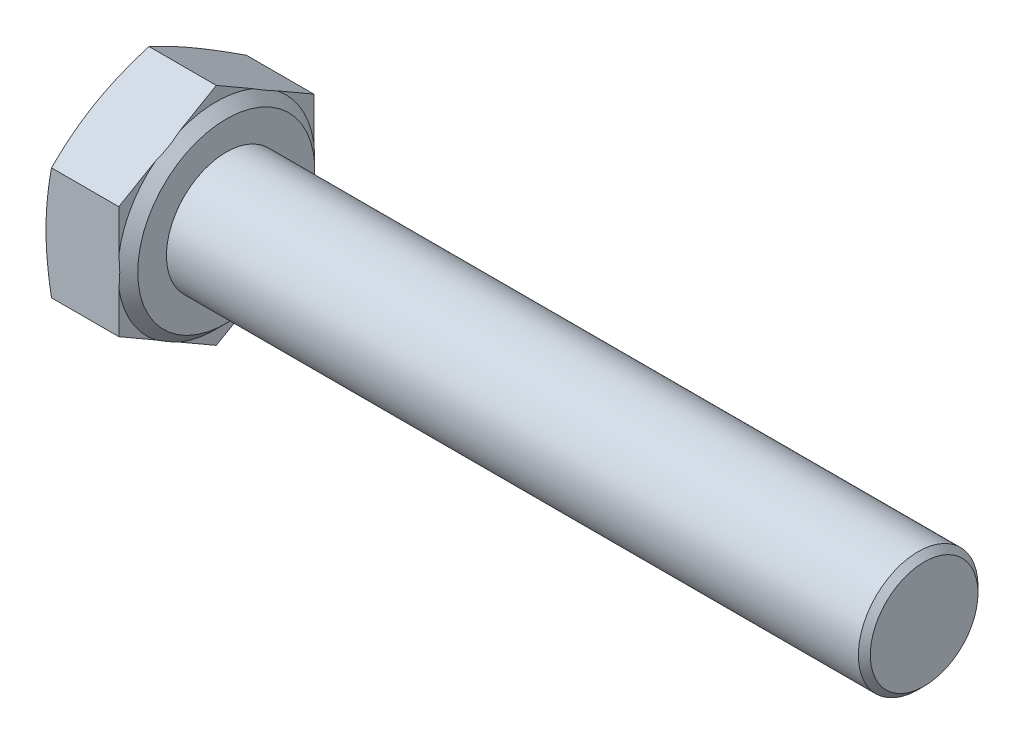
ISO-10303-21;
HEADER;
FILE_DESCRIPTION(('STEP AP214'),'2;1');
FILE_NAME('part.step','',(''),(''),'','','');
FILE_SCHEMA(('AUTOMOTIVE_DESIGN { 1 0 10303 214 1 1 1 1 }'));
ENDSEC;
DATA;
#1=APPLICATION_CONTEXT('core data for automotive mechanical design processes');
#2=APPLICATION_PROTOCOL_DEFINITION('international standard','automotive_design',2000,#1);
#3=PRODUCT_CONTEXT('',#1,'mechanical');
#4=PRODUCT('Part','Part','',(#3));
#5=PRODUCT_RELATED_PRODUCT_CATEGORY('part','',(#4));
#6=PRODUCT_DEFINITION_FORMATION('','',#4);
#7=PRODUCT_DEFINITION_CONTEXT('part definition',#1,'design');
#8=PRODUCT_DEFINITION('design','',#6,#7);
#9=PRODUCT_DEFINITION_SHAPE('','',#8);
#10=(LENGTH_UNIT() NAMED_UNIT(*) SI_UNIT(.MILLI.,.METRE.));
#11=(NAMED_UNIT(*) PLANE_ANGLE_UNIT() SI_UNIT($,.RADIAN.));
#12=(NAMED_UNIT(*) SI_UNIT($,.STERADIAN.) SOLID_ANGLE_UNIT());
#13=UNCERTAINTY_MEASURE_WITH_UNIT(LENGTH_MEASURE(1.E-05),#10,'distance_accuracy_value','');
#14=(GEOMETRIC_REPRESENTATION_CONTEXT(3) GLOBAL_UNCERTAINTY_ASSIGNED_CONTEXT((#13)) GLOBAL_UNIT_ASSIGNED_CONTEXT((#10,
#11,#12)) REPRESENTATION_CONTEXT('',''));
#15=CARTESIAN_POINT('',(0.,0.,0.));
#16=DIRECTION('',(0.,0.,1.));
#17=DIRECTION('',(1.,0.,0.));
#18=AXIS2_PLACEMENT_3D('',#15,#16,#17);
#19=CARTESIAN_POINT('',(4.15,-2.82324281633727,-4.89));
#20=DIRECTION('',(1.,0.,0.));
#21=DIRECTION('',(0.,0.,-1.));
#22=AXIS2_PLACEMENT_3D('',#19,#20,#21);
#23=PLANE('',#22);
#24=CARTESIAN_POINT('',(4.15,0.,0.));
#25=DIRECTION('',(-1.,0.,0.));
#26=DIRECTION('',(0.,0.,1.));
#27=AXIS2_PLACEMENT_3D('',#24,#25,#26);
#28=CIRCLE('',#27,4.44);
#29=CARTESIAN_POINT('',(4.15,0.,4.44));
#30=VERTEX_POINT('',#29);
#31=EDGE_CURVE('E349',#30,#30,#28,.T.);
#32=ORIENTED_EDGE('',*,*,#31,.F.);
#33=EDGE_LOOP('',(#32));
#34=FACE_BOUND('',#33,.T.);
#35=CARTESIAN_POINT('',(4.15,0.,0.));
#36=DIRECTION('',(1.,0.,0.));
#37=DIRECTION('',(0.,0.,-1.));
#38=AXIS2_PLACEMENT_3D('',#35,#36,#37);
#39=CIRCLE('',#38,3.);
#40=CARTESIAN_POINT('',(4.15,0.,-3.));
#41=VERTEX_POINT('',#40);
#42=EDGE_CURVE('E352',#41,#41,#39,.T.);
#43=ORIENTED_EDGE('',*,*,#42,.F.);
#44=EDGE_LOOP('',(#43));
#45=FACE_BOUND('',#44,.T.);
#46=ADVANCED_FACE('F37',(#34,#45),#23,.T.);
#47=CARTESIAN_POINT('',(4.15,-5.64648563267454,0.));
#48=DIRECTION('',(0.,0.866025403784439,0.5));
#49=DIRECTION('',(0.,-0.5,0.866025403784439));
#50=AXIS2_PLACEMENT_3D('',#47,#48,#49);
#51=PLANE('',#50);
#52=CARTESIAN_POINT('',(0.275380281895275,-2.82312734628343,-4.8902));
#53=CARTESIAN_POINT('',(0.232806027313738,-2.94005354571478,-4.68767788184897));
#54=CARTESIAN_POINT('',(0.194077322500994,-3.05736532610898,-4.48448791787986));
#55=CARTESIAN_POINT('',(0.125940094634839,-3.29275168688453,-4.07678678160786));
#56=CARTESIAN_POINT('',(0.0965388652659337,-3.4108267909009,-3.87227470234254));
#57=CARTESIAN_POINT('',(0.04898319610652,-3.64642938860635,-3.46419903272147));
#58=CARTESIAN_POINT('',(0.0307250265265993,-3.7639515012703,-3.26064476257468));
#59=CARTESIAN_POINT('',(0.00623568354141336,-3.9992705639038,-2.85306019010397));
#60=CARTESIAN_POINT('',(0.,-4.11706739420486,-2.64903009505199));
#61=CARTESIAN_POINT('',(0.,-4.35266105480695,-2.24096990494801));
#62=CARTESIAN_POINT('',(0.00623568354141334,-4.470457885108,-2.03693980989603));
#63=CARTESIAN_POINT('',(0.0307250265265992,-4.7057769477415,-1.62935523742532));
#64=CARTESIAN_POINT('',(0.0489831961065197,-4.82329906040545,-1.42580096727853));
#65=CARTESIAN_POINT('',(0.0965388652659334,-5.05890165811091,-1.01772529765746));
#66=CARTESIAN_POINT('',(0.125940094634839,-5.17697676212727,-0.81321321839214));
#67=CARTESIAN_POINT('',(0.194077322500994,-5.41236312290283,-0.405512082120141));
#68=CARTESIAN_POINT('',(0.232806027313738,-5.52967490329702,-0.202322118151033));
#69=CARTESIAN_POINT('',(0.275380281895275,-5.64660110272838,0.000200000000000261));
#70=B_SPLINE_CURVE_WITH_KNOTS('',3,(#52,#53,#54,#55,#56,#57,#58,#59,#60,#61,#62,#63,#64,#65,#66,
#67,#68,#69),.UNSPECIFIED.,.F.,.F.,(4,2,2,2,2,2,2,2,4),(0.,0.713162340175091,1.42688097587953,
2.13385008160519,2.84055392207798,3.54725776255078,4.25422686827643,4.96794550398088,
5.68110784415597),.UNSPECIFIED.);
#71=CARTESIAN_POINT('',(0.275338252943565,-2.82324281633728,-4.89));
#72=VERTEX_POINT('',#71);
#73=CARTESIAN_POINT('',(0.,-4.2348642245059,-2.445));
#74=VERTEX_POINT('',#73);
#75=EDGE_CURVE('E151',#72,#74,#70,.T.);
#76=ORIENTED_EDGE('',*,*,#75,.F.);
#77=DIRECTION('',(-1.,0.,0.));
#78=VECTOR('',#77,1.);
#79=CARTESIAN_POINT('',(4.15,-2.82324281633727,-4.89));
#80=LINE('',#79,#78);
#81=CARTESIAN_POINT('',(3.65,-2.82324281633728,-4.89));
#82=VERTEX_POINT('',#81);
#83=EDGE_CURVE('E180',#82,#72,#80,.T.);
#84=ORIENTED_EDGE('',*,*,#83,.F.);
#85=DIRECTION('',(0.,0.5,-0.866025403784439));
#86=VECTOR('',#85,1.);
#87=CARTESIAN_POINT('',(3.65,-5.64648563267454,0.));
#88=LINE('',#87,#86);
#89=CARTESIAN_POINT('',(3.65,-3.88432891957926,-3.05214495797959));
#90=VERTEX_POINT('',#89);
#91=EDGE_CURVE('E390',#90,#82,#88,.T.);
#92=ORIENTED_EDGE('',*,*,#91,.F.);
#93=CARTESIAN_POINT('',(3.6498,-4.58610347345172,-1.83663577521352));
#94=CARTESIAN_POINT('',(3.66642630233643,-4.52781095860013,-1.93760137263743));
#95=CARTESIAN_POINT('',(3.67899788281249,-4.46922077375917,-2.03908254960683));
#96=CARTESIAN_POINT('',(3.69576369124272,-4.35204080140414,-2.24204421535524));
#97=CARTESIAN_POINT('',(3.7000000000002,-4.29345251295301,-2.34352210768111));
#98=CARTESIAN_POINT('',(3.69999999999981,-4.17627593605075,-2.54647789233283));
#99=CARTESIAN_POINT('',(3.69576369124195,-4.11768764759962,-2.64795578465868));
#100=CARTESIAN_POINT('',(3.67899788281095,-4.00050767524463,-2.85091745040705));
#101=CARTESIAN_POINT('',(3.66642630233452,-3.94191749040369,-2.95239862737641));
#102=CARTESIAN_POINT('',(3.64979999999773,-3.88362497555213,-3.05336422480028));
#103=B_SPLINE_CURVE_WITH_KNOTS('',3,(#93,#94,#95,#96,#97,#98,#99,#100,#101,#102),.UNSPECIFIED.,
.F.,.F.,(4,2,2,2,4),(0.,0.353249681620507,0.704711351351669,1.05617302108283,1.40942270270333),.UNSPECIFIED.);
#104=CARTESIAN_POINT('',(3.65,-4.58539952943255,-1.8378550420204));
#105=VERTEX_POINT('',#104);
#106=EDGE_CURVE('E286',#105,#90,#103,.T.);
#107=ORIENTED_EDGE('',*,*,#106,.F.);
#108=CARTESIAN_POINT('',(3.65,-5.64648563267454,0.));
#109=VERTEX_POINT('',#108);
#110=EDGE_CURVE('E395',#109,#105,#88,.T.);
#111=ORIENTED_EDGE('',*,*,#110,.F.);
#112=DIRECTION('',(-1.,0.,0.));
#113=VECTOR('',#112,1.);
#114=CARTESIAN_POINT('',(4.15,-5.64648563267454,0.));
#115=LINE('',#114,#113);
#116=CARTESIAN_POINT('',(0.275338252943565,-5.64648563267454,0.));
#117=VERTEX_POINT('',#116);
#118=EDGE_CURVE('E174',#109,#117,#115,.T.);
#119=ORIENTED_EDGE('',*,*,#118,.T.);
#120=EDGE_CURVE('E205',#74,#117,#70,.T.);
#121=ORIENTED_EDGE('',*,*,#120,.F.);
#122=EDGE_LOOP('',(#76,#84,#92,#107,#111,#119,#121));
#123=FACE_BOUND('',#122,.T.);
#124=ADVANCED_FACE('F220',(#123),#51,.F.);
#125=CARTESIAN_POINT('',(4.15,-2.82324281633727,-4.89));
#126=DIRECTION('',(0.,0.,1.));
#127=DIRECTION('',(0.,-1.,0.));
#128=AXIS2_PLACEMENT_3D('',#125,#126,#127);
#129=PLANE('',#128);
#130=CARTESIAN_POINT('',(1.47129869483294,-7.47495512504367,-4.89));
#131=CARTESIAN_POINT('',(1.40393079506561,-7.25371380745917,-4.89));
#132=CARTESIAN_POINT('',(1.33734899090171,-7.03222867387441,-4.89));
#133=CARTESIAN_POINT('',(1.20619244069394,-6.5886466465259,-4.89));
#134=CARTESIAN_POINT('',(1.14161785346952,-6.36654970585932,-4.89));
#135=CARTESIAN_POINT('',(1.01480318479875,-5.92123979331613,-4.89));
#136=CARTESIAN_POINT('',(0.952567683745642,-5.69802551232848,-4.89));
#137=CARTESIAN_POINT('',(0.831159795919227,-5.25076661859942,-4.89));
#138=CARTESIAN_POINT('',(0.771987354147968,-5.02672202084402,-4.89));
#139=CARTESIAN_POINT('',(0.658168567133634,-4.58041537162197,-4.89));
#140=CARTESIAN_POINT('',(0.603475499602902,-4.35816529479306,-4.89));
#141=CARTESIAN_POINT('',(0.498748998066299,-3.91257195276905,-4.89));
#142=CARTESIAN_POINT('',(0.448715375036118,-3.68922873230784,-4.89));
#143=CARTESIAN_POINT('',(0.354469295981055,-3.24138004238269,-4.89));
#144=CARTESIAN_POINT('',(0.310255020382048,-3.01687495913455,-4.89));
#145=CARTESIAN_POINT('',(0.228995632651293,-2.56656138502389,-4.89));
#146=CARTESIAN_POINT('',(0.191950280318729,-2.34075293809283,-4.89));
#147=CARTESIAN_POINT('',(0.130201739040673,-1.91325959339141,-4.89));
#148=CARTESIAN_POINT('',(0.104580443076079,-1.7117085568808,-4.89));
#149=CARTESIAN_POINT('',(0.0612096920895598,-1.30775422612196,-4.89));
#150=CARTESIAN_POINT('',(0.0434600076807356,-1.10535095688221,-4.89));
#151=CARTESIAN_POINT('',(0.0166872681877653,-0.700102709087607,-4.89));
#152=CARTESIAN_POINT('',(0.00765804062714753,-0.497258144964858,-4.89));
#153=CARTESIAN_POINT('',(-0.00121663708547169,-0.0913660751023836,-4.89));
#154=CARTESIAN_POINT('',(-0.00106215209256402,0.111681429194059,-4.89));
#155=CARTESIAN_POINT('',(0.00844625202656065,0.518587666799134,-4.89));
#156=CARTESIAN_POINT('',(0.0178468221715271,0.722445291842698,-4.89));
#157=CARTESIAN_POINT('',(0.0454147821823927,1.12956176075136,-4.89));
#158=CARTESIAN_POINT('',(0.0635823826703748,1.33282059011276,-4.89));
#159=CARTESIAN_POINT('',(0.107834523969445,1.73863910447632,-4.89));
#160=CARTESIAN_POINT('',(0.133925864781556,1.94119803723647,-4.89));
#161=CARTESIAN_POINT('',(0.192967180359364,2.3453025411413,-4.89));
#162=CARTESIAN_POINT('',(0.225917191885122,2.54684810684875,-4.89));
#163=CARTESIAN_POINT('',(0.299499470611553,2.9595319008777,-4.89));
#164=CARTESIAN_POINT('',(0.340445907261211,3.17061361371584,-4.89));
#165=CARTESIAN_POINT('',(0.427609195485362,3.59169295990695,-4.89));
#166=CARTESIAN_POINT('',(0.473826444402166,3.80169051028091,-4.89));
#167=CARTESIAN_POINT('',(0.57055784155677,4.22074572323043,-4.89));
#168=CARTESIAN_POINT('',(0.621073114498197,4.42980312462705,-4.89));
#169=CARTESIAN_POINT('',(0.725589196608966,4.84704757471085,-4.89));
#170=CARTESIAN_POINT('',(0.779590123238275,5.0552345938158,-4.89));
#171=CARTESIAN_POINT('',(0.945945053824333,5.67918629952349,-4.89));
#172=CARTESIAN_POINT('',(1.06252758031575,6.09382183678496,-4.89));
#173=CARTESIAN_POINT('',(1.30317583577977,6.92081517299283,-4.89));
#174=CARTESIAN_POINT('',(1.42724037740026,7.33317332206916,-4.89));
#175=CARTESIAN_POINT('',(1.67916422383547,8.15174338199309,-4.89));
#176=CARTESIAN_POINT('',(1.80696652737127,8.55797289481873,-4.89));
#177=CARTESIAN_POINT('',(2.06620019396764,9.36928942869491,-4.89));
#178=CARTESIAN_POINT('',(2.19763173114595,9.77437639389888,-4.89));
#179=CARTESIAN_POINT('',(2.46263746207206,10.5821446703695,-4.89));
#180=CARTESIAN_POINT('',(2.59620163362652,10.9848292774608,-4.89));
#181=CARTESIAN_POINT('',(2.86533255796704,11.7894924176659,-4.89));
#182=CARTESIAN_POINT('',(3.00089914490487,12.1914710062036,-4.89));
#183=CARTESIAN_POINT('',(3.13716614236931,12.5932085295134,-4.89));
#184=B_SPLINE_CURVE_WITH_KNOTS('',3,(#130,#131,#132,#133,#134,#135,#136,#137,#138,#139,#140,
#141,#142,#143,#144,#145,#146,#147,#148,#149,#150,#151,#152,#153,#154,#155,#156,#157,#158,#159,
#160,#161,#162,#163,#164,#165,#166,#167,#168,#169,#170,#171,#172,#173,#174,#175,#176,#177,#178,
#179,#180,#181,#182,#183),.UNSPECIFIED.,.F.,.F.,(4,2,2,2,2,2,2,2,2,2,2,2,2,2,2,2,2,2,2,2,2,2,2,
2,2,2,4),(0.,0.693817131006209,1.38768902072047,2.08285550284901,2.77800949876783,
3.46461230832526,4.15118725164004,4.83754700639838,5.52388376011145,6.13326896898385,
6.74263641857425,7.35157223150889,7.96050374415836,8.57252345707315,9.18455787408724,
9.79711901860747,10.4096834463243,11.0546504543374,11.6996661156284,12.344851086316,
12.9900578098843,14.2820735292063,15.5738847499757,16.8514371609262,18.129050971161,
19.4018170786331,20.6744783550215),.UNSPECIFIED.);
#185=CARTESIAN_POINT('',(0.275338252943565,2.82324281633727,-4.89000000000001));
#186=VERTEX_POINT('',#185);
#187=CARTESIAN_POINT('',(0.,0.,-4.89));
#188=VERTEX_POINT('',#187);
#189=EDGE_CURVE('E265',#186,#188,#184,.F.);
#190=ORIENTED_EDGE('',*,*,#189,.F.);
#191=DIRECTION('',(-1.,0.,0.));
#192=VECTOR('',#191,1.);
#193=CARTESIAN_POINT('',(4.15,2.82324281633727,-4.89));
#194=LINE('',#193,#192);
#195=CARTESIAN_POINT('',(3.65,2.82324281633727,-4.89));
#196=VERTEX_POINT('',#195);
#197=EDGE_CURVE('E171',#196,#186,#194,.T.);
#198=ORIENTED_EDGE('',*,*,#197,.F.);
#199=DIRECTION('',(0.,1.,0.));
#200=VECTOR('',#199,1.);
#201=CARTESIAN_POINT('',(3.65,-2.82324281633727,-4.89));
#202=LINE('',#201,#200);
#203=CARTESIAN_POINT('',(3.65,0.701070609853286,-4.89));
#204=VERTEX_POINT('',#203);
#205=EDGE_CURVE('E396',#204,#196,#202,.T.);
#206=ORIENTED_EDGE('',*,*,#205,.F.);
#207=CARTESIAN_POINT('',(3.03451610167313,-2.63653206780597,-4.89));
#208=CARTESIAN_POINT('',(3.10849067572388,-2.48058820797332,-4.89));
#209=CARTESIAN_POINT('',(3.17843227251853,-2.3225658150431,-4.89));
#210=CARTESIAN_POINT('',(3.30815593937757,-2.00185975303429,-4.89));
#211=CARTESIAN_POINT('',(3.36790591157042,-1.83916317651322,-4.89));
#212=CARTESIAN_POINT('',(3.47430176536649,-1.51069530968842,-4.89));
#213=CARTESIAN_POINT('',(3.52103440039963,-1.34495262643883,-4.89));
#214=CARTESIAN_POINT('',(3.59941295927054,-1.01008442397128,-4.89));
#215=CARTESIAN_POINT('',(3.63107835052522,-0.840963565645151,-4.89));
#216=CARTESIAN_POINT('',(3.67067369985504,-0.549624485933594,-4.89));
#217=CARTESIAN_POINT('',(3.68281796567514,-0.427971801597364,-4.89));
#218=CARTESIAN_POINT('',(3.69804945216179,-0.184073425551839,-4.89));
#219=CARTESIAN_POINT('',(3.70113559934876,-0.0618276652763835,-4.89));
#220=CARTESIAN_POINT('',(3.69811824393208,0.182639197761048,-4.89));
#221=CARTESIAN_POINT('',(3.69200798941262,0.304860216451619,-4.89));
#222=CARTESIAN_POINT('',(3.67083296686346,0.548492985004842,-4.89));
#223=CARTESIAN_POINT('',(3.65576928101999,0.669904830877757,-4.89));
#224=CARTESIAN_POINT('',(3.60751278659157,0.972186481066579,-4.89));
#225=CARTESIAN_POINT('',(3.56901104925984,1.15221939847223,-4.89));
#226=CARTESIAN_POINT('',(3.47560353419222,1.50816362351894,-4.89));
#227=CARTESIAN_POINT('',(3.42067264113039,1.68406817287319,-4.89));
#228=CARTESIAN_POINT('',(3.29720232108195,2.0317979906774,-4.89));
#229=CARTESIAN_POINT('',(3.22860539819505,2.20360246792536,-4.89));
#230=CARTESIAN_POINT('',(3.08087349193912,2.54190390921175,-4.89));
#231=CARTESIAN_POINT('',(3.00177775794251,2.7084179096231,-4.89));
#232=CARTESIAN_POINT('',(2.91862888345722,2.87269043608181,-4.89));
#233=B_SPLINE_CURVE_WITH_KNOTS('',3,(#207,#208,#209,#210,#211,#212,#213,#214,#215,#216,#217,
#218,#219,#220,#221,#222,#223,#224,#225,#226,#227,#228,#229,#230,#231,#232),.UNSPECIFIED.,.F.,
.F.,(4,2,2,2,2,2,2,2,2,2,2,2,4),(0.,0.517967526591368,1.03753738829618,1.55355690657567,
2.06890788657605,2.43537052902186,2.80187659928168,3.16865188631198,3.53538285084041,
4.08673119441343,4.63892673258675,5.1934964962066,5.74604853278358),.UNSPECIFIED.);
#234=CARTESIAN_POINT('',(3.65,-0.701070609853285,-4.89));
#235=VERTEX_POINT('',#234);
#236=EDGE_CURVE('E280',#235,#204,#233,.T.);
#237=ORIENTED_EDGE('',*,*,#236,.F.);
#238=EDGE_CURVE('E392',#82,#235,#202,.T.);
#239=ORIENTED_EDGE('',*,*,#238,.F.);
#240=ORIENTED_EDGE('',*,*,#83,.T.);
#241=EDGE_CURVE('E162',#188,#72,#184,.F.);
#242=ORIENTED_EDGE('',*,*,#241,.F.);
#243=EDGE_LOOP('',(#190,#198,#206,#237,#239,#240,#242));
#244=FACE_BOUND('',#243,.T.);
#245=ADVANCED_FACE('F272',(#244),#129,.F.);
#246=CARTESIAN_POINT('',(4.15,2.82324281633727,-4.89));
#247=DIRECTION('',(0.,-0.866025403784438,0.5));
#248=DIRECTION('',(0.,-0.5,-0.866025403784439));
#249=AXIS2_PLACEMENT_3D('',#246,#247,#248);
#250=PLANE('',#249);
#251=CARTESIAN_POINT('',(0.275380281895276,5.64660110272838,0.000199999999999955));
#252=CARTESIAN_POINT('',(0.23280602731374,5.52967490329703,-0.202322118151033));
#253=CARTESIAN_POINT('',(0.194077322500996,5.41236312290283,-0.405512082120141));
#254=CARTESIAN_POINT('',(0.12594009463484,5.17697676212728,-0.81321321839214));
#255=CARTESIAN_POINT('',(0.0965388652659353,5.05890165811092,-1.01772529765746));
#256=CARTESIAN_POINT('',(0.0489831961065216,4.82329906040546,-1.42580096727853));
#257=CARTESIAN_POINT('',(0.030725026526601,4.70577694774151,-1.62935523742532));
#258=CARTESIAN_POINT('',(0.00623568354141499,4.47045788510801,-2.03693980989603));
#259=CARTESIAN_POINT('',(0.,4.35266105480696,-2.24096990494801));
#260=CARTESIAN_POINT('',(0.,4.11706739420486,-2.64903009505199));
#261=CARTESIAN_POINT('',(0.00623568354141481,3.99927056390381,-2.85306019010397));
#262=CARTESIAN_POINT('',(0.0307250265266005,3.76395150127031,-3.26064476257468));
#263=CARTESIAN_POINT('',(0.0489831961065208,3.64642938860636,-3.46419903272147));
#264=CARTESIAN_POINT('',(0.0965388652659342,3.4108267909009,-3.87227470234254));
#265=CARTESIAN_POINT('',(0.125940094634839,3.29275168688454,-4.07678678160786));
#266=CARTESIAN_POINT('',(0.194077322500995,3.05736532610898,-4.48448791787986));
#267=CARTESIAN_POINT('',(0.232806027313739,2.94005354571479,-4.68767788184897));
#268=CARTESIAN_POINT('',(0.275380281895275,2.82312734628344,-4.8902));
#269=B_SPLINE_CURVE_WITH_KNOTS('',3,(#251,#252,#253,#254,#255,#256,#257,#258,#259,#260,#261,
#262,#263,#264,#265,#266,#267,#268),.UNSPECIFIED.,.F.,.F.,(4,2,2,2,2,2,2,2,4),(0.,
0.713162340175091,1.42688097587953,2.13385008160519,2.84055392207798,3.54725776255078,
4.25422686827643,4.96794550398087,5.68110784415597),.UNSPECIFIED.);
#270=CARTESIAN_POINT('',(0.275338252943565,5.64648563267454,0.));
#271=VERTEX_POINT('',#270);
#272=CARTESIAN_POINT('',(0.,4.2348642245059,-2.445));
#273=VERTEX_POINT('',#272);
#274=EDGE_CURVE('E52',#271,#273,#269,.T.);
#275=ORIENTED_EDGE('',*,*,#274,.F.);
#276=DIRECTION('',(-1.,0.,0.));
#277=VECTOR('',#276,1.);
#278=CARTESIAN_POINT('',(4.15,5.64648563267454,0.));
#279=LINE('',#278,#277);
#280=CARTESIAN_POINT('',(3.65,5.64648563267454,0.));
#281=VERTEX_POINT('',#280);
#282=EDGE_CURVE('E168',#281,#271,#279,.T.);
#283=ORIENTED_EDGE('',*,*,#282,.F.);
#284=DIRECTION('',(0.,0.5,0.866025403784439));
#285=VECTOR('',#284,1.);
#286=CARTESIAN_POINT('',(3.65,2.82324281633727,-4.89));
#287=LINE('',#286,#285);
#288=CARTESIAN_POINT('',(3.65,4.58539952943254,-1.83785504202043));
#289=VERTEX_POINT('',#288);
#290=EDGE_CURVE('E420',#289,#281,#287,.T.);
#291=ORIENTED_EDGE('',*,*,#290,.F.);
#292=CARTESIAN_POINT('',(3.64979999999773,3.88362497555214,-3.05336422480026));
#293=CARTESIAN_POINT('',(3.66642630233452,3.9419174904037,-2.9523986273764));
#294=CARTESIAN_POINT('',(3.67899788281095,4.00050767524464,-2.85091745040704));
#295=CARTESIAN_POINT('',(3.69576369124194,4.11768764759963,-2.64795578465868));
#296=CARTESIAN_POINT('',(3.69999999999981,4.17627593605075,-2.54647789233283));
#297=CARTESIAN_POINT('',(3.7000000000002,4.29345251295301,-2.34352210768112));
#298=CARTESIAN_POINT('',(3.69576369124271,4.35204080140414,-2.24204421535526));
#299=CARTESIAN_POINT('',(3.67899788281248,4.46922077375916,-2.03908254960685));
#300=CARTESIAN_POINT('',(3.66642630233643,4.52781095860012,-1.93760137263746));
#301=CARTESIAN_POINT('',(3.6498,4.5861034734517,-1.83663577521355));
#302=B_SPLINE_CURVE_WITH_KNOTS('',3,(#292,#293,#294,#295,#296,#297,#298,#299,#300,#301),
.UNSPECIFIED.,.F.,.F.,(4,2,2,2,4),(0.,0.35324968162049,0.704711351351636,1.05617302108278,
1.40942270270327),.UNSPECIFIED.);
#303=CARTESIAN_POINT('',(3.65,3.88432891957928,-3.05214495797958));
#304=VERTEX_POINT('',#303);
#305=EDGE_CURVE('E287',#304,#289,#302,.T.);
#306=ORIENTED_EDGE('',*,*,#305,.F.);
#307=EDGE_CURVE('E415',#196,#304,#287,.T.);
#308=ORIENTED_EDGE('',*,*,#307,.F.);
#309=ORIENTED_EDGE('',*,*,#197,.T.);
#310=EDGE_CURVE('E266',#273,#186,#269,.T.);
#311=ORIENTED_EDGE('',*,*,#310,.F.);
#312=EDGE_LOOP('',(#275,#283,#291,#306,#308,#309,#311));
#313=FACE_BOUND('',#312,.T.);
#314=ADVANCED_FACE('F275',(#313),#250,.F.);
#315=CARTESIAN_POINT('',(4.15,5.64648563267454,0.));
#316=DIRECTION('',(0.,-0.866025403784439,-0.5));
#317=DIRECTION('',(0.,0.5,-0.866025403784439));
#318=AXIS2_PLACEMENT_3D('',#315,#316,#317);
#319=PLANE('',#318);
#320=CARTESIAN_POINT('',(0.275380281895276,2.82312734628344,4.8902));
#321=CARTESIAN_POINT('',(0.232806027313739,2.94005354571479,4.68767788184897));
#322=CARTESIAN_POINT('',(0.194077322500995,3.05736532610898,4.48448791787986));
#323=CARTESIAN_POINT('',(0.12594009463484,3.29275168688454,4.07678678160786));
#324=CARTESIAN_POINT('',(0.0965388652659349,3.4108267909009,3.87227470234254));
#325=CARTESIAN_POINT('',(0.0489831961065214,3.64642938860636,3.46419903272147));
#326=CARTESIAN_POINT('',(0.0307250265266009,3.76395150127031,3.26064476257468));
#327=CARTESIAN_POINT('',(0.00623568354141494,3.99927056390381,2.85306019010397));
#328=CARTESIAN_POINT('',(0.,4.11706739420486,2.64903009505199));
#329=CARTESIAN_POINT('',(0.,4.35266105480696,2.24096990494801));
#330=CARTESIAN_POINT('',(0.00623568354141513,4.47045788510801,2.03693980989603));
#331=CARTESIAN_POINT('',(0.0307250265266012,4.70577694774151,1.62935523742532));
#332=CARTESIAN_POINT('',(0.0489831961065217,4.82329906040546,1.42580096727853));
#333=CARTESIAN_POINT('',(0.0965388652659353,5.05890165811092,1.01772529765746));
#334=CARTESIAN_POINT('',(0.12594009463484,5.17697676212728,0.813213218392142));
#335=CARTESIAN_POINT('',(0.194077322500996,5.41236312290283,0.405512082120142));
#336=CARTESIAN_POINT('',(0.23280602731374,5.52967490329703,0.202322118151033));
#337=CARTESIAN_POINT('',(0.275380281895277,5.64660110272838,-0.000200000000000052));
#338=B_SPLINE_CURVE_WITH_KNOTS('',3,(#320,#321,#322,#323,#324,#325,#326,#327,#328,#329,#330,
#331,#332,#333,#334,#335,#336,#337),.UNSPECIFIED.,.F.,.F.,(4,2,2,2,2,2,2,2,4),(0.,
0.713162340175092,1.42688097587953,2.13385008160519,2.84055392207798,3.54725776255078,
4.25422686827643,4.96794550398087,5.68110784415597),.UNSPECIFIED.);
#339=CARTESIAN_POINT('',(0.275338252943565,2.82324281633728,4.89));
#340=VERTEX_POINT('',#339);
#341=CARTESIAN_POINT('',(0.,4.2348642245059,2.445));
#342=VERTEX_POINT('',#341);
#343=EDGE_CURVE('E60',#340,#342,#338,.T.);
#344=ORIENTED_EDGE('',*,*,#343,.F.);
#345=DIRECTION('',(-1.,0.,0.));
#346=VECTOR('',#345,1.);
#347=CARTESIAN_POINT('',(4.15,2.82324281633727,4.89));
#348=LINE('',#347,#346);
#349=CARTESIAN_POINT('',(3.65,2.82324281633728,4.89));
#350=VERTEX_POINT('',#349);
#351=EDGE_CURVE('E159',#350,#340,#348,.T.);
#352=ORIENTED_EDGE('',*,*,#351,.F.);
#353=DIRECTION('',(0.,-0.5,0.866025403784439));
#354=VECTOR('',#353,1.);
#355=CARTESIAN_POINT('',(3.65,5.64648563267454,0.));
#356=LINE('',#355,#354);
#357=CARTESIAN_POINT('',(3.65,3.88432891957928,3.05214495797957));
#358=VERTEX_POINT('',#357);
#359=EDGE_CURVE('E427',#358,#350,#356,.T.);
#360=ORIENTED_EDGE('',*,*,#359,.F.);
#361=CARTESIAN_POINT('',(3.6498,4.5861034734517,1.83663577521355));
#362=CARTESIAN_POINT('',(3.66642630233632,4.52781095860048,1.93760137263682));
#363=CARTESIAN_POINT('',(3.67899788281232,4.4692207737599,2.03908254960557));
#364=CARTESIAN_POINT('',(3.69576369124256,4.35204080140561,2.24204421535271));
#365=CARTESIAN_POINT('',(3.70000000000009,4.29345251295485,2.34352210767793));
#366=CARTESIAN_POINT('',(3.69999999999992,4.17627593605332,2.54647789232838));
#367=CARTESIAN_POINT('',(3.69576369124221,4.11768764760256,2.6479557846536));
#368=CARTESIAN_POINT('',(3.67899788281163,4.00050767524829,2.85091745040072));
#369=CARTESIAN_POINT('',(3.66642630233546,3.94191749040771,2.95239862736945));
#370=CARTESIAN_POINT('',(3.64979999999897,3.8836249755565,3.0533642247927));
#371=B_SPLINE_CURVE_WITH_KNOTS('',3,(#361,#362,#363,#364,#365,#366,#367,#368,#369,#370),
.UNSPECIFIED.,.F.,.F.,(4,2,2,2,4),(0.,0.353249681618273,0.704711351347235,1.0561730210762,
1.40942270269447),.UNSPECIFIED.);
#372=CARTESIAN_POINT('',(3.65,4.58539952943254,1.83785504202043));
#373=VERTEX_POINT('',#372);
#374=EDGE_CURVE('E319',#373,#358,#371,.T.);
#375=ORIENTED_EDGE('',*,*,#374,.F.);
#376=EDGE_CURVE('E426',#281,#373,#356,.T.);
#377=ORIENTED_EDGE('',*,*,#376,.F.);
#378=ORIENTED_EDGE('',*,*,#282,.T.);
#379=EDGE_CURVE('E161',#342,#271,#338,.T.);
#380=ORIENTED_EDGE('',*,*,#379,.F.);
#381=EDGE_LOOP('',(#344,#352,#360,#375,#377,#378,#380));
#382=FACE_BOUND('',#381,.T.);
#383=ADVANCED_FACE('F157',(#382),#319,.F.);
#384=CARTESIAN_POINT('',(4.15,2.82324281633727,4.89));
#385=DIRECTION('',(0.,0.,-1.));
#386=DIRECTION('',(-1.,0.,0.));
#387=AXIS2_PLACEMENT_3D('',#384,#385,#386);
#388=PLANE('',#387);
#389=CARTESIAN_POINT('',(1.47129843051555,-7.47495425724796,4.89));
#390=CARTESIAN_POINT('',(1.40393054332345,-7.25371297327245,4.89));
#391=CARTESIAN_POINT('',(1.33734875170117,-7.03222787331575,4.89));
#392=CARTESIAN_POINT('',(1.20619222642614,-6.5886459132952,4.89));
#393=CARTESIAN_POINT('',(1.14161765159282,-6.36654900632852,4.89));
#394=CARTESIAN_POINT('',(1.01480300753387,-5.92123916149788,4.89));
#395=CARTESIAN_POINT('',(0.952567518699377,-5.69802491452353,4.89));
#396=CARTESIAN_POINT('',(0.831159654925676,-5.25076608896255,4.89));
#397=CARTESIAN_POINT('',(0.771987224988546,-5.0267215253619,4.89));
#398=CARTESIAN_POINT('',(0.658168460903987,-4.58041494423012,4.89));
#399=CARTESIAN_POINT('',(0.603475404476185,-4.35816490133425,4.89));
#400=CARTESIAN_POINT('',(0.498748924258513,-3.91257162743952,4.89));
#401=CARTESIAN_POINT('',(0.448715311444419,-3.68922844117453,4.89));
#402=CARTESIAN_POINT('',(0.354469251487066,-3.24137981990804,4.89));
#403=CARTESIAN_POINT('',(0.310254984771775,-3.01687477112187,4.89));
#404=CARTESIAN_POINT('',(0.228995612914628,-2.56656126632831,4.89));
#405=CARTESIAN_POINT('',(0.191950267572438,-2.34075285425229,4.89));
#406=CARTESIAN_POINT('',(0.130201731357065,-1.91325953628954,4.89));
#407=CARTESIAN_POINT('',(0.104580435079536,-1.71170849142527,4.89));
#408=CARTESIAN_POINT('',(0.0612096842313694,-1.30775414391415,4.89));
#409=CARTESIAN_POINT('',(0.0434600002738133,-1.10535086627579,4.89));
#410=CARTESIAN_POINT('',(0.0166872625123732,-0.700102601701751,4.89));
#411=CARTESIAN_POINT('',(0.00765803623114323,-0.497258029198195,4.89));
#412=CARTESIAN_POINT('',(-0.00121663811733558,-0.091365942641825,4.89));
#413=CARTESIAN_POINT('',(-0.00106215103967757,0.111681569967707,4.89));
#414=CARTESIAN_POINT('',(0.00844625795837151,0.518587824423099,4.89));
#415=CARTESIAN_POINT('',(0.0178468309147351,0.722445458002957,4.89));
#416=CARTESIAN_POINT('',(0.0454147970903182,1.12956194383816,4.89));
#417=CARTESIAN_POINT('',(0.0635824009316985,1.33282078158978,4.89));
#418=CARTESIAN_POINT('',(0.107834549289372,1.73863931262525,4.89));
#419=CARTESIAN_POINT('',(0.133925893808018,1.94119825366685,4.89));
#420=CARTESIAN_POINT('',(0.192967216980313,2.34530277401886,4.89));
#421=CARTESIAN_POINT('',(0.225917232394029,2.54684834789205,4.89));
#422=CARTESIAN_POINT('',(0.299499517650744,2.95953215010376,4.89));
#423=CARTESIAN_POINT('',(0.340445956688628,3.1706138630007,4.89));
#424=CARTESIAN_POINT('',(0.427609249291963,3.59169320933632,4.89));
#425=CARTESIAN_POINT('',(0.473826500199633,3.80169075979598,4.89));
#426=CARTESIAN_POINT('',(0.570557900999628,4.22074597294804,4.89));
#427=CARTESIAN_POINT('',(0.621073175595285,4.42980337446154,4.89));
#428=CARTESIAN_POINT('',(0.725589260740133,4.84704782482264,4.89));
#429=CARTESIAN_POINT('',(0.779590188749263,5.05523484408802,4.89));
#430=CARTESIAN_POINT('',(0.945945123104759,5.67918655017082,4.89));
#431=CARTESIAN_POINT('',(1.06252765165215,6.09382208771138,4.89));
#432=CARTESIAN_POINT('',(1.30317591067348,6.92081542462388,4.89));
#433=CARTESIAN_POINT('',(1.42724045379556,7.33317357412567,4.89));
#434=CARTESIAN_POINT('',(1.67916430203802,8.15174363231447,4.89));
#435=CARTESIAN_POINT('',(1.80696660584999,8.5579731429888,4.89));
#436=CARTESIAN_POINT('',(2.06620027272763,9.3692896726391,4.89));
#437=CARTESIAN_POINT('',(2.197631809911,9.77437663576853,4.89));
#438=CARTESIAN_POINT('',(2.46263754077596,10.5821449084831,4.89));
#439=CARTESIAN_POINT('',(2.59620171226703,10.9848295138919,4.89));
#440=CARTESIAN_POINT('',(2.86533263635875,11.7894926507764,4.89));
#441=CARTESIAN_POINT('',(3.0008992231112,12.1914712376759,4.89));
#442=CARTESIAN_POINT('',(3.13716622035365,12.5932087593599,4.89));
#443=B_SPLINE_CURVE_WITH_KNOTS('',3,(#389,#390,#391,#392,#393,#394,#395,#396,#397,#398,#399,
#400,#401,#402,#403,#404,#405,#406,#407,#408,#409,#410,#411,#412,#413,#414,#415,#416,#417,#418,
#419,#420,#421,#422,#423,#424,#425,#426,#427,#428,#429,#430,#431,#432,#433,#434,#435,#436,#437,
#438,#439,#440,#441,#442),.UNSPECIFIED.,.F.,.F.,(4,2,2,2,2,2,2,2,2,2,2,2,2,2,2,2,2,2,2,2,2,2,2,
2,2,2,4),(0.,0.693817023561642,1.38768880581803,2.08285517981212,2.7780090676014,
3.46461177035686,4.15118660688119,4.83754625508125,5.52388290227977,6.1332681361085,
6.74263561065466,7.35157144850728,7.9605029860748,8.57252272493959,9.18455716790882,
9.79711833848642,10.4096827922613,11.0546498018249,11.6996654646589,12.3448504368587,
12.9900571619358,14.2820728837525,15.5738841070477,16.8514365120941,18.1290503164153,
19.4018164190377,20.6744776905923),.UNSPECIFIED.);
#444=CARTESIAN_POINT('',(0.275338252943565,-2.82324281633726,4.89000000000001));
#445=VERTEX_POINT('',#444);
#446=CARTESIAN_POINT('',(0.,0.,4.89));
#447=VERTEX_POINT('',#446);
#448=EDGE_CURVE('E153',#445,#447,#443,.T.);
#449=ORIENTED_EDGE('',*,*,#448,.F.);
#450=DIRECTION('',(-1.,0.,0.));
#451=VECTOR('',#450,1.);
#452=CARTESIAN_POINT('',(4.15,-2.82324281633727,4.89));
#453=LINE('',#452,#451);
#454=CARTESIAN_POINT('',(3.65,-2.82324281633726,4.89000000000001));
#455=VERTEX_POINT('',#454);
#456=EDGE_CURVE('E169',#455,#445,#453,.T.);
#457=ORIENTED_EDGE('',*,*,#456,.F.);
#458=DIRECTION('',(0.,-1.,0.));
#459=VECTOR('',#458,1.);
#460=CARTESIAN_POINT('',(3.65,2.82324281633727,4.89));
#461=LINE('',#460,#459);
#462=CARTESIAN_POINT('',(3.65,-0.701070609853286,4.89));
#463=VERTEX_POINT('',#462);
#464=EDGE_CURVE('E366',#463,#455,#461,.T.);
#465=ORIENTED_EDGE('',*,*,#464,.F.);
#466=CARTESIAN_POINT('',(3.03451610167314,-2.63653206780596,4.89));
#467=CARTESIAN_POINT('',(3.10849067572388,-2.48058820797332,4.89));
#468=CARTESIAN_POINT('',(3.17843227251853,-2.3225658150431,4.89));
#469=CARTESIAN_POINT('',(3.30815593937757,-2.00185975303429,4.89));
#470=CARTESIAN_POINT('',(3.36790591157042,-1.83916317651322,4.89));
#471=CARTESIAN_POINT('',(3.47430176536649,-1.51069530968842,4.89));
#472=CARTESIAN_POINT('',(3.52103440039963,-1.34495262643883,4.89));
#473=CARTESIAN_POINT('',(3.59941295927054,-1.01008442397128,4.89));
#474=CARTESIAN_POINT('',(3.63107835052522,-0.840963565645149,4.89));
#475=CARTESIAN_POINT('',(3.67067369985504,-0.549624485933593,4.89));
#476=CARTESIAN_POINT('',(3.68281796567514,-0.427971801597362,4.89));
#477=CARTESIAN_POINT('',(3.69804945216179,-0.184073425551837,4.89));
#478=CARTESIAN_POINT('',(3.70113559934876,-0.0618276652763815,4.89));
#479=CARTESIAN_POINT('',(3.69811824393208,0.18263919776105,4.89));
#480=CARTESIAN_POINT('',(3.69200798941262,0.304860216451621,4.89));
#481=CARTESIAN_POINT('',(3.67083296686345,0.548492985004844,4.89));
#482=CARTESIAN_POINT('',(3.65576928101999,0.669904830877759,4.89));
#483=CARTESIAN_POINT('',(3.60751278659157,0.97218648106658,4.89));
#484=CARTESIAN_POINT('',(3.56901104925984,1.15221939847223,4.89));
#485=CARTESIAN_POINT('',(3.47560353419221,1.50816362351894,4.89));
#486=CARTESIAN_POINT('',(3.42067264113038,1.68406817287319,4.89));
#487=CARTESIAN_POINT('',(3.29720232108195,2.0317979906774,4.89));
#488=CARTESIAN_POINT('',(3.22860539819505,2.20360246792536,4.89));
#489=CARTESIAN_POINT('',(3.08087349193912,2.54190390921176,4.89));
#490=CARTESIAN_POINT('',(3.00177775794251,2.7084179096231,4.89));
#491=CARTESIAN_POINT('',(2.91862888345722,2.87269043608181,4.89));
#492=B_SPLINE_CURVE_WITH_KNOTS('',3,(#466,#467,#468,#469,#470,#471,#472,#473,#474,#475,#476,
#477,#478,#479,#480,#481,#482,#483,#484,#485,#486,#487,#488,#489,#490,#491),.UNSPECIFIED.,.F.,
.F.,(4,2,2,2,2,2,2,2,2,2,2,2,4),(0.,0.517967526591366,1.03753738829618,1.55355690657567,
2.06890788657605,2.43537052902186,2.80187659928168,3.16865188631198,3.53538285084041,
4.08673119441343,4.63892673258675,5.1934964962066,5.74604853278358),.UNSPECIFIED.);
#493=CARTESIAN_POINT('',(3.65,0.701070609853286,4.89));
#494=VERTEX_POINT('',#493);
#495=EDGE_CURVE('E314',#494,#463,#492,.F.);
#496=ORIENTED_EDGE('',*,*,#495,.F.);
#497=EDGE_CURVE('E167',#350,#494,#461,.T.);
#498=ORIENTED_EDGE('',*,*,#497,.F.);
#499=ORIENTED_EDGE('',*,*,#351,.T.);
#500=EDGE_CURVE('E143',#447,#340,#443,.T.);
#501=ORIENTED_EDGE('',*,*,#500,.F.);
#502=EDGE_LOOP('',(#449,#457,#465,#496,#498,#499,#501));
#503=FACE_BOUND('',#502,.T.);
#504=ADVANCED_FACE('F165',(#503),#388,.F.);
#505=CARTESIAN_POINT('',(4.15,-2.82324281633727,4.89));
#506=DIRECTION('',(0.,0.866025403784439,-0.5));
#507=DIRECTION('',(0.,0.5,0.866025403784439));
#508=AXIS2_PLACEMENT_3D('',#505,#506,#507);
#509=PLANE('',#508);
#510=CARTESIAN_POINT('',(0.275380281895275,-5.64660110272838,-0.000199999999999634));
#511=CARTESIAN_POINT('',(0.232806027313738,-5.52967490329702,0.202322118151034));
#512=CARTESIAN_POINT('',(0.194077322500994,-5.41236312290283,0.405512082120142));
#513=CARTESIAN_POINT('',(0.125940094634839,-5.17697676212727,0.813213218392141));
#514=CARTESIAN_POINT('',(0.0965388652659333,-5.05890165811091,1.01772529765746));
#515=CARTESIAN_POINT('',(0.0489831961065197,-4.82329906040545,1.42580096727853));
#516=CARTESIAN_POINT('',(0.0307250265265993,-4.7057769477415,1.62935523742532));
#517=CARTESIAN_POINT('',(0.00623568354141324,-4.470457885108,2.03693980989603));
#518=CARTESIAN_POINT('',(0.,-4.35266105480695,2.24096990494801));
#519=CARTESIAN_POINT('',(0.,-4.11706739420485,2.64903009505199));
#520=CARTESIAN_POINT('',(0.00623568354141332,-3.9992705639038,2.85306019010397));
#521=CARTESIAN_POINT('',(0.0307250265265993,-3.7639515012703,3.26064476257468));
#522=CARTESIAN_POINT('',(0.0489831961065195,-3.64642938860635,3.46419903272147));
#523=CARTESIAN_POINT('',(0.096538865265933,-3.41082679090089,3.87227470234254));
#524=CARTESIAN_POINT('',(0.125940094634838,-3.29275168688453,4.07678678160786));
#525=CARTESIAN_POINT('',(0.194077322500994,-3.05736532610898,4.48448791787986));
#526=CARTESIAN_POINT('',(0.232806027313738,-2.94005354571478,4.68767788184897));
#527=CARTESIAN_POINT('',(0.275380281895274,-2.82312734628343,4.8902));
#528=B_SPLINE_CURVE_WITH_KNOTS('',3,(#510,#511,#512,#513,#514,#515,#516,#517,#518,#519,#520,
#521,#522,#523,#524,#525,#526,#527),.UNSPECIFIED.,.F.,.F.,(4,2,2,2,2,2,2,2,4),(0.,
0.713162340175091,1.42688097587953,2.13385008160519,2.84055392207798,3.54725776255078,
4.25422686827643,4.96794550398087,5.68110784415597),.UNSPECIFIED.);
#529=CARTESIAN_POINT('',(0.,-4.2348642245059,2.445));
#530=VERTEX_POINT('',#529);
#531=EDGE_CURVE('E207',#117,#530,#528,.T.);
#532=ORIENTED_EDGE('',*,*,#531,.F.);
#533=ORIENTED_EDGE('',*,*,#118,.F.);
#534=DIRECTION('',(0.,-0.5,-0.866025403784439));
#535=VECTOR('',#534,1.);
#536=CARTESIAN_POINT('',(3.65,-2.82324281633727,4.89));
#537=LINE('',#536,#535);
#538=CARTESIAN_POINT('',(3.65,-4.58539952943255,1.8378550420204));
#539=VERTEX_POINT('',#538);
#540=EDGE_CURVE('E183',#539,#109,#537,.T.);
#541=ORIENTED_EDGE('',*,*,#540,.F.);
#542=CARTESIAN_POINT('',(3.64979999999897,-3.88362497555648,3.05336422479274));
#543=CARTESIAN_POINT('',(3.66642630233546,-3.94191749040768,2.95239862736948));
#544=CARTESIAN_POINT('',(3.67899788281163,-4.00050767524827,2.85091745040074));
#545=CARTESIAN_POINT('',(3.69576369124221,-4.11768764760255,2.64795578465362));
#546=CARTESIAN_POINT('',(3.69999999999992,-4.17627593605331,2.54647789232839));
#547=CARTESIAN_POINT('',(3.70000000000009,-4.29345251295485,2.34352210767793));
#548=CARTESIAN_POINT('',(3.69576369124256,-4.35204080140561,2.2420442153527));
#549=CARTESIAN_POINT('',(3.67899788281233,-4.4692207737599,2.03908254960555));
#550=CARTESIAN_POINT('',(3.66642630233632,-4.5278109586005,1.93760137263679));
#551=CARTESIAN_POINT('',(3.6498,-4.58610347345172,1.83663577521352));
#552=B_SPLINE_CURVE_WITH_KNOTS('',3,(#542,#543,#544,#545,#546,#547,#548,#549,#550,#551),
.UNSPECIFIED.,.F.,.F.,(4,2,2,2,4),(0.,0.353249681618294,0.704711351347278,1.05617302107626,
1.40942270269456),.UNSPECIFIED.);
#553=CARTESIAN_POINT('',(3.65,-3.88432891957926,3.0521449579796));
#554=VERTEX_POINT('',#553);
#555=EDGE_CURVE('E306',#554,#539,#552,.T.);
#556=ORIENTED_EDGE('',*,*,#555,.F.);
#557=EDGE_CURVE('E185',#455,#554,#537,.T.);
#558=ORIENTED_EDGE('',*,*,#557,.F.);
#559=ORIENTED_EDGE('',*,*,#456,.T.);
#560=EDGE_CURVE('E252',#530,#445,#528,.T.);
#561=ORIENTED_EDGE('',*,*,#560,.F.);
#562=EDGE_LOOP('',(#532,#533,#541,#556,#558,#559,#561));
#563=FACE_BOUND('',#562,.T.);
#564=ADVANCED_FACE('F328',(#563),#509,.F.);
#565=CARTESIAN_POINT('',(3.65,4.94,0.));
#566=DIRECTION('',(1.,0.,0.));
#567=DIRECTION('',(0.,0.,-1.));
#568=AXIS2_PLACEMENT_3D('',#565,#566,#567);
#569=PLANE('',#568);
#570=ORIENTED_EDGE('',*,*,#91,.T.);
#571=ORIENTED_EDGE('',*,*,#238,.T.);
#572=CARTESIAN_POINT('',(3.65,0.,0.));
#573=DIRECTION('',(-1.,0.,0.));
#574=DIRECTION('',(0.,0.,1.));
#575=AXIS2_PLACEMENT_3D('',#572,#573,#574);
#576=CIRCLE('',#575,4.94);
#577=EDGE_CURVE('E372',#235,#90,#576,.T.);
#578=ORIENTED_EDGE('',*,*,#577,.T.);
#579=EDGE_LOOP('',(#570,#571,#578));
#580=FACE_BOUND('',#579,.T.);
#581=ADVANCED_FACE('F248',(#580),#569,.T.);
#582=ORIENTED_EDGE('',*,*,#205,.T.);
#583=ORIENTED_EDGE('',*,*,#307,.T.);
#584=EDGE_CURVE('E378',#304,#204,#576,.T.);
#585=ORIENTED_EDGE('',*,*,#584,.T.);
#586=EDGE_LOOP('',(#582,#583,#585));
#587=FACE_BOUND('',#586,.T.);
#588=ADVANCED_FACE('F406',(#587),#569,.T.);
#589=ORIENTED_EDGE('',*,*,#290,.T.);
#590=ORIENTED_EDGE('',*,*,#376,.T.);
#591=EDGE_CURVE('E374',#373,#289,#576,.T.);
#592=ORIENTED_EDGE('',*,*,#591,.T.);
#593=EDGE_LOOP('',(#589,#590,#592));
#594=FACE_BOUND('',#593,.T.);
#595=ADVANCED_FACE('F410',(#594),#569,.T.);
#596=ORIENTED_EDGE('',*,*,#359,.T.);
#597=ORIENTED_EDGE('',*,*,#497,.T.);
#598=EDGE_CURVE('E371',#494,#358,#576,.T.);
#599=ORIENTED_EDGE('',*,*,#598,.T.);
#600=EDGE_LOOP('',(#596,#597,#599));
#601=FACE_BOUND('',#600,.T.);
#602=ADVANCED_FACE('F404',(#601),#569,.T.);
#603=ORIENTED_EDGE('',*,*,#464,.T.);
#604=ORIENTED_EDGE('',*,*,#557,.T.);
#605=EDGE_CURVE('E365',#554,#463,#576,.T.);
#606=ORIENTED_EDGE('',*,*,#605,.T.);
#607=EDGE_LOOP('',(#603,#604,#606));
#608=FACE_BOUND('',#607,.T.);
#609=ADVANCED_FACE('F364',(#608),#569,.T.);
#610=ORIENTED_EDGE('',*,*,#110,.T.);
#611=EDGE_CURVE('E370',#105,#539,#576,.T.);
#612=ORIENTED_EDGE('',*,*,#611,.T.);
#613=ORIENTED_EDGE('',*,*,#540,.T.);
#614=EDGE_LOOP('',(#610,#612,#613));
#615=FACE_BOUND('',#614,.T.);
#616=ADVANCED_FACE('F300',(#615),#569,.T.);
#617=CARTESIAN_POINT('',(3.65,0.,0.));
#618=DIRECTION('',(-1.,0.,0.));
#619=DIRECTION('',(0.,0.,1.));
#620=AXIS2_PLACEMENT_3D('',#617,#618,#619);
#621=CONICAL_SURFACE('',#620,4.94,0.785398163397453);
#622=ORIENTED_EDGE('',*,*,#31,.T.);
#623=EDGE_LOOP('',(#622));
#624=FACE_BOUND('',#623,.T.);
#625=ORIENTED_EDGE('',*,*,#106,.T.);
#626=ORIENTED_EDGE('',*,*,#577,.F.);
#627=ORIENTED_EDGE('',*,*,#236,.T.);
#628=ORIENTED_EDGE('',*,*,#584,.F.);
#629=ORIENTED_EDGE('',*,*,#305,.T.);
#630=ORIENTED_EDGE('',*,*,#591,.F.);
#631=ORIENTED_EDGE('',*,*,#374,.T.);
#632=ORIENTED_EDGE('',*,*,#598,.F.);
#633=ORIENTED_EDGE('',*,*,#495,.T.);
#634=ORIENTED_EDGE('',*,*,#605,.F.);
#635=ORIENTED_EDGE('',*,*,#555,.T.);
#636=ORIENTED_EDGE('',*,*,#611,.F.);
#637=EDGE_LOOP('',(#625,#626,#627,#628,#629,#630,#631,#632,#633,#634,#635,#636));
#638=FACE_BOUND('',#637,.T.);
#639=ADVANCED_FACE('F296',(#624,#638),#621,.T.);
#640=CARTESIAN_POINT('',(0.,0.,0.));
#641=DIRECTION('',(1.,0.,0.));
#642=DIRECTION('',(0.,0.,-1.));
#643=AXIS2_PLACEMENT_3D('',#640,#641,#642);
#644=CONICAL_SURFACE('',#643,4.89,1.22173047639604);
#645=ORIENTED_EDGE('',*,*,#241,.T.);
#646=ORIENTED_EDGE('',*,*,#75,.T.);
#647=CARTESIAN_POINT('',(0.,0.,0.));
#648=DIRECTION('',(1.,0.,0.));
#649=DIRECTION('',(0.,0.,-1.));
#650=AXIS2_PLACEMENT_3D('',#647,#648,#649);
#651=CIRCLE('',#650,4.89);
#652=EDGE_CURVE('E186',#74,#188,#651,.T.);
#653=ORIENTED_EDGE('',*,*,#652,.T.);
#654=EDGE_LOOP('',(#645,#646,#653));
#655=FACE_BOUND('',#654,.T.);
#656=ADVANCED_FACE('F213',(#655),#644,.T.);
#657=ORIENTED_EDGE('',*,*,#120,.T.);
#658=ORIENTED_EDGE('',*,*,#531,.T.);
#659=EDGE_CURVE('E188',#530,#74,#651,.T.);
#660=ORIENTED_EDGE('',*,*,#659,.T.);
#661=EDGE_LOOP('',(#657,#658,#660));
#662=FACE_BOUND('',#661,.T.);
#663=ADVANCED_FACE('F203',(#662),#644,.T.);
#664=ORIENTED_EDGE('',*,*,#448,.T.);
#665=EDGE_CURVE('E197',#447,#530,#651,.T.);
#666=ORIENTED_EDGE('',*,*,#665,.T.);
#667=ORIENTED_EDGE('',*,*,#560,.T.);
#668=EDGE_LOOP('',(#664,#666,#667));
#669=FACE_BOUND('',#668,.T.);
#670=ADVANCED_FACE('F245',(#669),#644,.T.);
#671=ORIENTED_EDGE('',*,*,#343,.T.);
#672=CARTESIAN_POINT('',(0.,0.,0.));
#673=DIRECTION('',(-1.,0.,0.));
#674=DIRECTION('',(0.,0.,1.));
#675=AXIS2_PLACEMENT_3D('',#672,#673,#674);
#676=CIRCLE('',#675,4.89);
#677=EDGE_CURVE('E146',#447,#342,#676,.T.);
#678=ORIENTED_EDGE('',*,*,#677,.F.);
#679=ORIENTED_EDGE('',*,*,#500,.T.);
#680=EDGE_LOOP('',(#671,#678,#679));
#681=FACE_BOUND('',#680,.T.);
#682=ADVANCED_FACE('F144',(#681),#644,.T.);
#683=ORIENTED_EDGE('',*,*,#274,.T.);
#684=EDGE_CURVE('E193',#273,#342,#651,.T.);
#685=ORIENTED_EDGE('',*,*,#684,.T.);
#686=ORIENTED_EDGE('',*,*,#379,.T.);
#687=EDGE_LOOP('',(#683,#685,#686));
#688=FACE_BOUND('',#687,.T.);
#689=ADVANCED_FACE('F239',(#688),#644,.T.);
#690=ORIENTED_EDGE('',*,*,#310,.T.);
#691=ORIENTED_EDGE('',*,*,#189,.T.);
#692=EDGE_CURVE('E189',#188,#273,#651,.T.);
#693=ORIENTED_EDGE('',*,*,#692,.T.);
#694=EDGE_LOOP('',(#690,#691,#693));
#695=FACE_BOUND('',#694,.T.);
#696=ADVANCED_FACE('F244',(#695),#644,.T.);
#697=CARTESIAN_POINT('',(0.,-2.82324281633727,-4.89));
#698=DIRECTION('',(1.,0.,0.));
#699=DIRECTION('',(0.,0.,-1.));
#700=AXIS2_PLACEMENT_3D('',#697,#698,#699);
#701=PLANE('',#700);
#702=ORIENTED_EDGE('',*,*,#692,.F.);
#703=ORIENTED_EDGE('',*,*,#652,.F.);
#704=ORIENTED_EDGE('',*,*,#659,.F.);
#705=ORIENTED_EDGE('',*,*,#665,.F.);
#706=ORIENTED_EDGE('',*,*,#677,.T.);
#707=ORIENTED_EDGE('',*,*,#684,.F.);
#708=EDGE_LOOP('',(#702,#703,#704,#705,#706,#707));
#709=FACE_BOUND('',#708,.T.);
#710=ADVANCED_FACE('F218',(#709),#701,.F.);
#711=CARTESIAN_POINT('',(39.15,0.,0.));
#712=DIRECTION('',(-1.,0.,0.));
#713=DIRECTION('',(0.,0.,1.));
#714=AXIS2_PLACEMENT_3D('',#711,#712,#713);
#715=CYLINDRICAL_SURFACE('',#714,3.);
#716=CARTESIAN_POINT('',(38.85,0.,0.));
#717=DIRECTION('',(1.,0.,0.));
#718=DIRECTION('',(0.,0.,-1.));
#719=AXIS2_PLACEMENT_3D('',#716,#717,#718);
#720=CIRCLE('',#719,3.);
#721=CARTESIAN_POINT('',(38.85,0.,-3.));
#722=VERTEX_POINT('',#721);
#723=EDGE_CURVE('E11',#722,#722,#720,.F.);
#724=ORIENTED_EDGE('',*,*,#723,.T.);
#725=EDGE_LOOP('',(#724));
#726=FACE_BOUND('',#725,.T.);
#727=ORIENTED_EDGE('',*,*,#42,.T.);
#728=EDGE_LOOP('',(#727));
#729=FACE_BOUND('',#728,.T.);
#730=ADVANCED_FACE('F246',(#726,#729),#715,.T.);
#731=CARTESIAN_POINT('',(39.15,0.,0.));
#732=DIRECTION('',(1.,0.,0.));
#733=DIRECTION('',(0.,0.,-1.));
#734=AXIS2_PLACEMENT_3D('',#731,#732,#733);
#735=PLANE('',#734);
#736=CARTESIAN_POINT('',(39.15,0.,0.));
#737=DIRECTION('',(1.,0.,0.));
#738=DIRECTION('',(0.,0.,-1.));
#739=AXIS2_PLACEMENT_3D('',#736,#737,#738);
#740=CIRCLE('',#739,2.7);
#741=CARTESIAN_POINT('',(39.15,0.,-2.7));
#742=VERTEX_POINT('',#741);
#743=EDGE_CURVE('E45',#742,#742,#740,.T.);
#744=ORIENTED_EDGE('',*,*,#743,.T.);
#745=EDGE_LOOP('',(#744));
#746=FACE_BOUND('',#745,.T.);
#747=ADVANCED_FACE('F339',(#746),#735,.T.);
#748=CARTESIAN_POINT('',(39.15,0.,0.));
#749=DIRECTION('',(-1.,0.,0.));
#750=DIRECTION('',(0.,0.,1.));
#751=AXIS2_PLACEMENT_3D('',#748,#749,#750);
#752=CONICAL_SURFACE('',#751,2.7,0.785398163397439);
#753=ORIENTED_EDGE('',*,*,#723,.F.);
#754=EDGE_LOOP('',(#753));
#755=FACE_BOUND('',#754,.T.);
#756=ORIENTED_EDGE('',*,*,#743,.F.);
#757=EDGE_LOOP('',(#756));
#758=FACE_BOUND('',#757,.T.);
#759=ADVANCED_FACE('F39',(#755,#758),#752,.T.);
#760=CLOSED_SHELL('',(#46,#124,#245,#314,#383,#504,#564,#581,#588,#595,#602,#609,#616,#639,#656,
#663,#670,#682,#689,#696,#710,#730,#747,#759));
#761=MANIFOLD_SOLID_BREP('B2',#760);
#762=ADVANCED_BREP_SHAPE_REPRESENTATION('',(#18,#761),#14);
#763=SHAPE_DEFINITION_REPRESENTATION(#9,#762);
ENDSEC;
END-ISO-10303-21;
